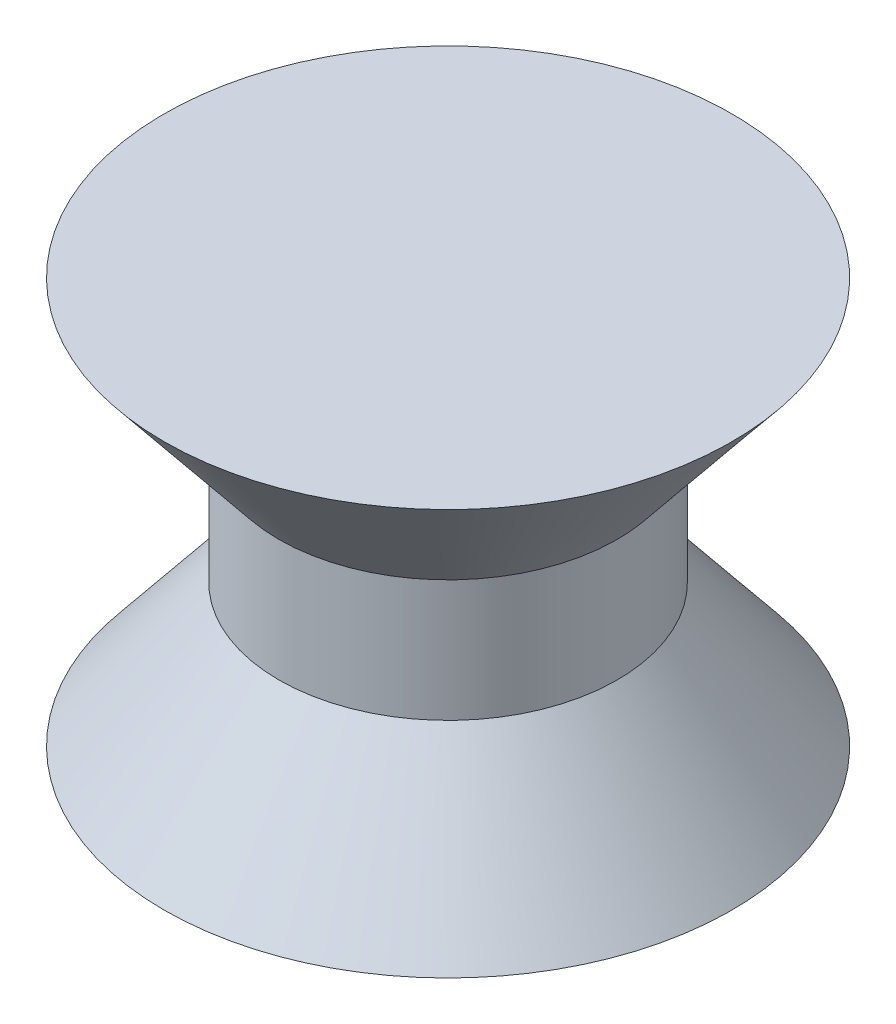
ISO-10303-21;
HEADER;
FILE_DESCRIPTION(('STEP AP214'),'2;1');
FILE_NAME('part.step','',(''),(''),'','','');
FILE_SCHEMA(('AUTOMOTIVE_DESIGN { 1 0 10303 214 1 1 1 1 }'));
ENDSEC;
DATA;
#1=APPLICATION_CONTEXT('core data for automotive mechanical design processes');
#2=APPLICATION_PROTOCOL_DEFINITION('international standard','automotive_design',2000,#1);
#3=PRODUCT_CONTEXT('',#1,'mechanical');
#4=PRODUCT('Part','Part','',(#3));
#5=PRODUCT_RELATED_PRODUCT_CATEGORY('part','',(#4));
#6=PRODUCT_DEFINITION_FORMATION('','',#4);
#7=PRODUCT_DEFINITION_CONTEXT('part definition',#1,'design');
#8=PRODUCT_DEFINITION('design','',#6,#7);
#9=PRODUCT_DEFINITION_SHAPE('','',#8);
#10=(LENGTH_UNIT() NAMED_UNIT(*) SI_UNIT(.MILLI.,.METRE.));
#11=(NAMED_UNIT(*) PLANE_ANGLE_UNIT() SI_UNIT($,.RADIAN.));
#12=(NAMED_UNIT(*) SI_UNIT($,.STERADIAN.) SOLID_ANGLE_UNIT());
#13=UNCERTAINTY_MEASURE_WITH_UNIT(LENGTH_MEASURE(1.E-05),#10,'distance_accuracy_value','');
#14=(GEOMETRIC_REPRESENTATION_CONTEXT(3) GLOBAL_UNCERTAINTY_ASSIGNED_CONTEXT((#13)) GLOBAL_UNIT_ASSIGNED_CONTEXT((#10,
#11,#12)) REPRESENTATION_CONTEXT('',''));
#15=CARTESIAN_POINT('',(0.,0.,0.));
#16=DIRECTION('',(0.,0.,1.));
#17=DIRECTION('',(1.,0.,0.));
#18=AXIS2_PLACEMENT_3D('',#15,#16,#17);
#19=CARTESIAN_POINT('',(0.,-5.,0.));
#20=DIRECTION('',(0.,-1.,0.));
#21=DIRECTION('',(0.,0.,-1.));
#22=AXIS2_PLACEMENT_3D('',#19,#20,#21);
#23=CONICAL_SURFACE('',#22,7.,0.679527777758375);
#24=CARTESIAN_POINT('',(0.,-1.5,0.));
#25=DIRECTION('',(0.,1.,0.));
#26=DIRECTION('',(0.,0.,1.));
#27=AXIS2_PLACEMENT_3D('',#24,#25,#26);
#28=CIRCLE('',#27,4.17241772791819);
#29=CARTESIAN_POINT('',(0.,-1.5,4.17241772791819));
#30=VERTEX_POINT('',#29);
#31=EDGE_CURVE('E10',#30,#30,#28,.T.);
#32=ORIENTED_EDGE('',*,*,#31,.F.);
#33=EDGE_LOOP('',(#32));
#34=FACE_BOUND('',#33,.T.);
#35=CARTESIAN_POINT('',(0.,-5.,0.));
#36=DIRECTION('',(0.,1.,0.));
#37=DIRECTION('',(0.,0.,1.));
#38=AXIS2_PLACEMENT_3D('',#35,#36,#37);
#39=CIRCLE('',#38,7.);
#40=CARTESIAN_POINT('',(0.,-5.,7.));
#41=VERTEX_POINT('',#40);
#42=EDGE_CURVE('E48',#41,#41,#39,.T.);
#43=ORIENTED_EDGE('',*,*,#42,.T.);
#44=EDGE_LOOP('',(#43));
#45=FACE_BOUND('',#44,.T.);
#46=ADVANCED_FACE('F34',(#34,#45),#23,.T.);
#47=CARTESIAN_POINT('',(0.,14.056584815892,0.));
#48=DIRECTION('',(0.,1.,0.));
#49=DIRECTION('',(0.,0.,1.));
#50=AXIS2_PLACEMENT_3D('',#47,#48,#49);
#51=CYLINDRICAL_SURFACE('',#50,4.17241772791819);
#52=CARTESIAN_POINT('',(0.,1.5,0.));
#53=DIRECTION('',(0.,1.,0.));
#54=DIRECTION('',(0.,0.,1.));
#55=AXIS2_PLACEMENT_3D('',#52,#53,#54);
#56=CIRCLE('',#55,4.17241772791819);
#57=CARTESIAN_POINT('',(0.,1.5,4.17241772791819));
#58=VERTEX_POINT('',#57);
#59=EDGE_CURVE('E40',#58,#58,#56,.T.);
#60=ORIENTED_EDGE('',*,*,#59,.F.);
#61=EDGE_LOOP('',(#60));
#62=FACE_BOUND('',#61,.T.);
#63=ORIENTED_EDGE('',*,*,#31,.T.);
#64=EDGE_LOOP('',(#63));
#65=FACE_BOUND('',#64,.T.);
#66=ADVANCED_FACE('F76',(#62,#65),#51,.T.);
#67=CARTESIAN_POINT('',(0.,1.5,0.));
#68=DIRECTION('',(0.,1.,0.));
#69=DIRECTION('',(0.,0.,1.));
#70=AXIS2_PLACEMENT_3D('',#67,#68,#69);
#71=CONICAL_SURFACE('',#70,4.17241772791819,0.679527777758375);
#72=CARTESIAN_POINT('',(0.,5.,0.));
#73=DIRECTION('',(0.,1.,0.));
#74=DIRECTION('',(0.,0.,1.));
#75=AXIS2_PLACEMENT_3D('',#72,#73,#74);
#76=CIRCLE('',#75,7.);
#77=CARTESIAN_POINT('',(0.,5.,7.));
#78=VERTEX_POINT('',#77);
#79=EDGE_CURVE('E44',#78,#78,#76,.T.);
#80=ORIENTED_EDGE('',*,*,#79,.F.);
#81=EDGE_LOOP('',(#80));
#82=FACE_BOUND('',#81,.T.);
#83=ORIENTED_EDGE('',*,*,#59,.T.);
#84=EDGE_LOOP('',(#83));
#85=FACE_BOUND('',#84,.T.);
#86=ADVANCED_FACE('F81',(#82,#85),#71,.T.);
#87=CARTESIAN_POINT('',(0.,5.,0.));
#88=DIRECTION('',(0.,-1.,0.));
#89=DIRECTION('',(0.,0.,-1.));
#90=AXIS2_PLACEMENT_3D('',#87,#88,#89);
#91=PLANE('',#90);
#92=ORIENTED_EDGE('',*,*,#79,.T.);
#93=EDGE_LOOP('',(#92));
#94=FACE_BOUND('',#93,.T.);
#95=ADVANCED_FACE('F71',(#94),#91,.F.);
#96=CARTESIAN_POINT('',(0.,-5.,0.));
#97=DIRECTION('',(0.,1.,0.));
#98=DIRECTION('',(0.,0.,1.));
#99=AXIS2_PLACEMENT_3D('',#96,#97,#98);
#100=PLANE('',#99);
#101=CARTESIAN_POINT('',(0.,-5.,0.));
#102=DIRECTION('',(0.,-1.,0.));
#103=DIRECTION('',(0.,0.,-1.));
#104=AXIS2_PLACEMENT_3D('',#101,#102,#103);
#105=CIRCLE('',#104,1.5);
#106=CARTESIAN_POINT('',(0.,-5.,-1.5));
#107=VERTEX_POINT('',#106);
#108=EDGE_CURVE('E54',#107,#107,#105,.T.);
#109=ORIENTED_EDGE('',*,*,#108,.F.);
#110=EDGE_LOOP('',(#109));
#111=FACE_BOUND('',#110,.T.);
#112=ORIENTED_EDGE('',*,*,#42,.F.);
#113=EDGE_LOOP('',(#112));
#114=FACE_BOUND('',#113,.T.);
#115=ADVANCED_FACE('F65',(#111,#114),#100,.F.);
#116=CARTESIAN_POINT('',(0.,-3.,0.));
#117=DIRECTION('',(0.,-1.,0.));
#118=DIRECTION('',(0.,0.,-1.));
#119=AXIS2_PLACEMENT_3D('',#116,#117,#118);
#120=CYLINDRICAL_SURFACE('',#119,1.5);
#121=CARTESIAN_POINT('',(0.,-3.,0.));
#122=DIRECTION('',(0.,-1.,0.));
#123=DIRECTION('',(0.,0.,-1.));
#124=AXIS2_PLACEMENT_3D('',#121,#122,#123);
#125=CIRCLE('',#124,1.5);
#126=CARTESIAN_POINT('',(0.,-3.,-1.5));
#127=VERTEX_POINT('',#126);
#128=EDGE_CURVE('E53',#127,#127,#125,.T.);
#129=ORIENTED_EDGE('',*,*,#128,.F.);
#130=EDGE_LOOP('',(#129));
#131=FACE_BOUND('',#130,.T.);
#132=ORIENTED_EDGE('',*,*,#108,.T.);
#133=EDGE_LOOP('',(#132));
#134=FACE_BOUND('',#133,.T.);
#135=ADVANCED_FACE('F62',(#131,#134),#120,.F.);
#136=CARTESIAN_POINT('',(0.,-3.,0.));
#137=DIRECTION('',(0.,-1.,0.));
#138=DIRECTION('',(0.,0.,-1.));
#139=AXIS2_PLACEMENT_3D('',#136,#137,#138);
#140=PLANE('',#139);
#141=ORIENTED_EDGE('',*,*,#128,.T.);
#142=EDGE_LOOP('',(#141));
#143=FACE_BOUND('',#142,.T.);
#144=ADVANCED_FACE('F60',(#143),#140,.T.);
#145=CLOSED_SHELL('',(#46,#66,#86,#95,#115,#135,#144));
#146=MANIFOLD_SOLID_BREP('B2',#145);
#147=ADVANCED_BREP_SHAPE_REPRESENTATION('',(#18,#146),#14);
#148=SHAPE_DEFINITION_REPRESENTATION(#9,#147);
ENDSEC;
END-ISO-10303-21;
